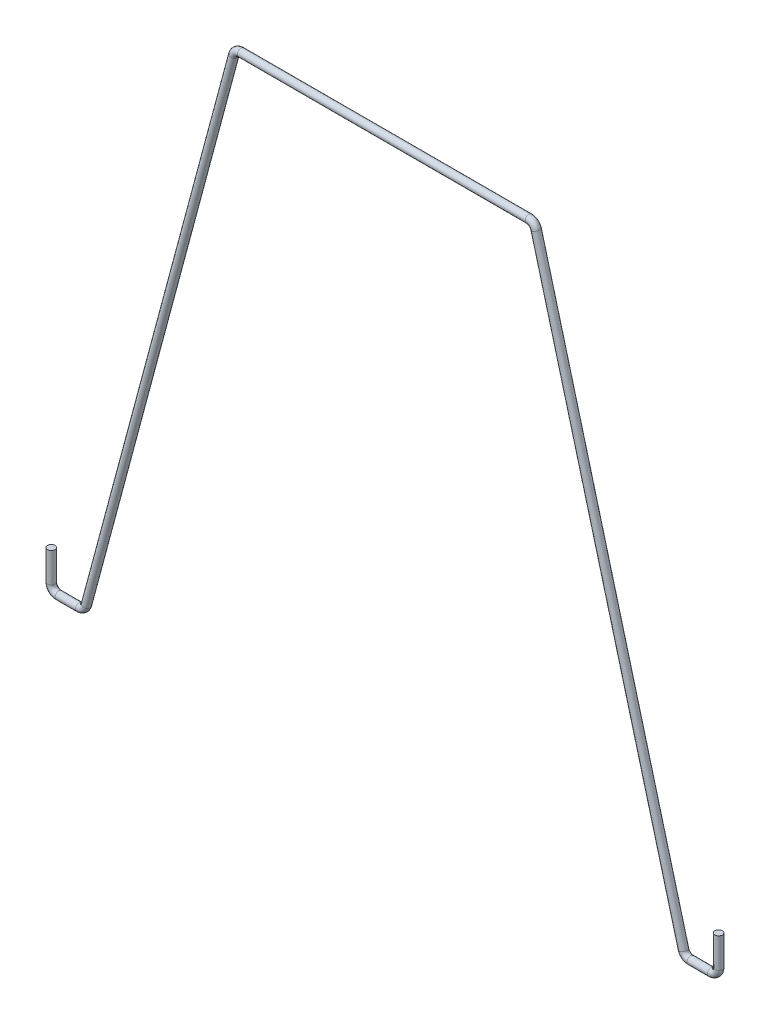
ISO-10303-21;
HEADER;
FILE_DESCRIPTION(('STEP AP214'),'2;1');
FILE_NAME('part.step','',(''),(''),'','','');
FILE_SCHEMA(('AUTOMOTIVE_DESIGN { 1 0 10303 214 1 1 1 1 }'));
ENDSEC;
DATA;
#1=APPLICATION_CONTEXT('core data for automotive mechanical design processes');
#2=APPLICATION_PROTOCOL_DEFINITION('international standard','automotive_design',2000,#1);
#3=PRODUCT_CONTEXT('',#1,'mechanical');
#4=PRODUCT('Part','Part','',(#3));
#5=PRODUCT_RELATED_PRODUCT_CATEGORY('part','',(#4));
#6=PRODUCT_DEFINITION_FORMATION('','',#4);
#7=PRODUCT_DEFINITION_CONTEXT('part definition',#1,'design');
#8=PRODUCT_DEFINITION('design','',#6,#7);
#9=PRODUCT_DEFINITION_SHAPE('','',#8);
#10=(LENGTH_UNIT() NAMED_UNIT(*) SI_UNIT(.MILLI.,.METRE.));
#11=(NAMED_UNIT(*) PLANE_ANGLE_UNIT() SI_UNIT($,.RADIAN.));
#12=(NAMED_UNIT(*) SI_UNIT($,.STERADIAN.) SOLID_ANGLE_UNIT());
#13=UNCERTAINTY_MEASURE_WITH_UNIT(LENGTH_MEASURE(1.E-05),#10,'distance_accuracy_value','');
#14=(GEOMETRIC_REPRESENTATION_CONTEXT(3) GLOBAL_UNCERTAINTY_ASSIGNED_CONTEXT((#13)) GLOBAL_UNIT_ASSIGNED_CONTEXT((#10,
#11,#12)) REPRESENTATION_CONTEXT('',''));
#15=CARTESIAN_POINT('',(0.,0.,0.));
#16=DIRECTION('',(0.,0.,1.));
#17=DIRECTION('',(1.,0.,0.));
#18=AXIS2_PLACEMENT_3D('',#15,#16,#17);
#19=CARTESIAN_POINT('',(-22.6548642316256,-35.56,0.));
#20=DIRECTION('',(0.,1.,0.));
#21=DIRECTION('',(-1.,0.,0.));
#22=AXIS2_PLACEMENT_3D('',#19,#20,#21);
#23=PLANE('',#22);
#24=CARTESIAN_POINT('',(-22.6548642316256,-35.56,0.));
#25=DIRECTION('',(0.,1.,0.));
#26=DIRECTION('',(-1.,0.,0.));
#27=AXIS2_PLACEMENT_3D('',#24,#25,#26);
#28=CIRCLE('',#27,0.254000000000001);
#29=CARTESIAN_POINT('',(-22.9088642316256,-35.56,0.));
#30=VERTEX_POINT('',#29);
#31=EDGE_CURVE('E108',#30,#30,#28,.T.);
#32=ORIENTED_EDGE('',*,*,#31,.T.);
#33=EDGE_LOOP('',(#32));
#34=FACE_BOUND('',#33,.T.);
#35=ADVANCED_FACE('F49',(#34),#23,.T.);
#36=CARTESIAN_POINT('',(22.6548642316259,-35.5599999999998,0.));
#37=DIRECTION('',(0.,-1.,0.));
#38=DIRECTION('',(1.,0.,0.));
#39=AXIS2_PLACEMENT_3D('',#36,#37,#38);
#40=PLANE('',#39);
#41=CARTESIAN_POINT('',(22.6548642316259,-35.5599999999998,0.));
#42=DIRECTION('',(0.,-1.,0.));
#43=DIRECTION('',(1.,0.,0.));
#44=AXIS2_PLACEMENT_3D('',#41,#42,#43);
#45=CIRCLE('',#44,0.254000000000001);
#46=CARTESIAN_POINT('',(22.9088642316259,-35.5599999999998,0.));
#47=VERTEX_POINT('',#46);
#48=EDGE_CURVE('E11',#47,#47,#45,.T.);
#49=ORIENTED_EDGE('',*,*,#48,.F.);
#50=EDGE_LOOP('',(#49));
#51=FACE_BOUND('',#50,.T.);
#52=ADVANCED_FACE('F117',(#51),#40,.F.);
#53=CARTESIAN_POINT('',(-22.6548642316256,-35.56,0.));
#54=DIRECTION('',(0.,-1.,0.));
#55=DIRECTION('',(1.,0.,0.));
#56=AXIS2_PLACEMENT_3D('',#53,#54,#55);
#57=CYLINDRICAL_SURFACE('',#56,0.254000000000001);
#58=CARTESIAN_POINT('',(-22.6548642316256,-37.592,0.));
#59=DIRECTION('',(0.,1.,0.));
#60=DIRECTION('',(-1.,0.,0.));
#61=AXIS2_PLACEMENT_3D('',#58,#59,#60);
#62=CIRCLE('',#61,0.254000000000001);
#63=CARTESIAN_POINT('',(-22.9088642316256,-37.592,0.));
#64=VERTEX_POINT('',#63);
#65=EDGE_CURVE('E104',#64,#64,#62,.T.);
#66=ORIENTED_EDGE('',*,*,#65,.T.);
#67=EDGE_LOOP('',(#66));
#68=FACE_BOUND('',#67,.T.);
#69=ORIENTED_EDGE('',*,*,#31,.F.);
#70=EDGE_LOOP('',(#69));
#71=FACE_BOUND('',#70,.T.);
#72=ADVANCED_FACE('F114',(#68,#71),#57,.T.);
#73=CARTESIAN_POINT('',(-22.1468642316256,-37.592,0.));
#74=DIRECTION('',(0.,0.,1.));
#75=DIRECTION('',(1.,0.,0.));
#76=AXIS2_PLACEMENT_3D('',#73,#74,#75);
#77=TOROIDAL_SURFACE('',#76,0.508000000000002,0.254000000000001);
#78=CARTESIAN_POINT('',(-22.1468642316256,-38.1,0.));
#79=DIRECTION('',(-1.,0.,0.));
#80=DIRECTION('',(0.,-1.,0.));
#81=AXIS2_PLACEMENT_3D('',#78,#79,#80);
#82=CIRCLE('',#81,0.254000000000001);
#83=CARTESIAN_POINT('',(-22.1468642316256,-38.354,0.));
#84=VERTEX_POINT('',#83);
#85=EDGE_CURVE('E100',#84,#84,#82,.T.);
#86=CARTESIAN_POINT('',(-22.1468642316256,-37.592,0.));
#87=DIRECTION('',(0.,0.,1.));
#88=DIRECTION('',(1.,0.,0.));
#89=AXIS2_PLACEMENT_3D('',#86,#87,#88);
#90=CIRCLE('',#89,0.762000000000002);
#91=EDGE_CURVE('',#64,#84,#90,.T.);
#92=ORIENTED_EDGE('',*,*,#65,.F.);
#93=ORIENTED_EDGE('',*,*,#85,.T.);
#94=ORIENTED_EDGE('',*,*,#91,.T.);
#95=ORIENTED_EDGE('',*,*,#91,.F.);
#96=EDGE_LOOP('',(#92,#94,#93,#95));
#97=FACE_BOUND('',#96,.T.);
#98=ADVANCED_FACE('F116',(#97),#77,.T.);
#99=CARTESIAN_POINT('',(-22.1468642316256,-38.1,0.));
#100=DIRECTION('',(1.,0.,0.));
#101=DIRECTION('',(0.,1.,0.));
#102=AXIS2_PLACEMENT_3D('',#99,#100,#101);
#103=CYLINDRICAL_SURFACE('',#102,0.254000000000001);
#104=CARTESIAN_POINT('',(-20.758666341519,-38.1,0.));
#105=DIRECTION('',(-1.,0.,0.));
#106=DIRECTION('',(0.,-1.,0.));
#107=AXIS2_PLACEMENT_3D('',#104,#105,#106);
#108=CIRCLE('',#107,0.254000000000001);
#109=CARTESIAN_POINT('',(-20.758666341519,-38.354,0.));
#110=VERTEX_POINT('',#109);
#111=EDGE_CURVE('E96',#110,#110,#108,.T.);
#112=ORIENTED_EDGE('',*,*,#111,.T.);
#113=EDGE_LOOP('',(#112));
#114=FACE_BOUND('',#113,.T.);
#115=ORIENTED_EDGE('',*,*,#85,.F.);
#116=EDGE_LOOP('',(#115));
#117=FACE_BOUND('',#116,.T.);
#118=ADVANCED_FACE('F124',(#114,#117),#103,.T.);
#119=CARTESIAN_POINT('',(-20.758666341519,-37.592,0.));
#120=DIRECTION('',(0.,0.,1.));
#121=DIRECTION('',(1.,0.,0.));
#122=AXIS2_PLACEMENT_3D('',#119,#120,#121);
#123=TOROIDAL_SURFACE('',#122,0.508000000000002,0.254000000000001);
#124=CARTESIAN_POINT('',(-20.2679760217641,-37.7234800749121,0.));
#125=DIRECTION('',(-0.258819045102509,-0.965925826289072,0.));
#126=DIRECTION('',(0.965925826289071,-0.258819045102509,0.));
#127=AXIS2_PLACEMENT_3D('',#124,#125,#126);
#128=CIRCLE('',#127,0.254000000000001);
#129=CARTESIAN_POINT('',(-20.0226308618867,-37.7892201123681,0.));
#130=VERTEX_POINT('',#129);
#131=EDGE_CURVE('E92',#130,#130,#128,.T.);
#132=CARTESIAN_POINT('',(-20.758666341519,-37.592,0.));
#133=DIRECTION('',(0.,0.,1.));
#134=DIRECTION('',(1.,0.,0.));
#135=AXIS2_PLACEMENT_3D('',#132,#133,#134);
#136=CIRCLE('',#135,0.762000000000002);
#137=EDGE_CURVE('',#110,#130,#136,.T.);
#138=ORIENTED_EDGE('',*,*,#111,.F.);
#139=ORIENTED_EDGE('',*,*,#131,.T.);
#140=ORIENTED_EDGE('',*,*,#137,.T.);
#141=ORIENTED_EDGE('',*,*,#137,.F.);
#142=EDGE_LOOP('',(#138,#140,#139,#141));
#143=FACE_BOUND('',#142,.T.);
#144=ADVANCED_FACE('F165',(#143),#123,.T.);
#145=CARTESIAN_POINT('',(-20.2679760217641,-37.7234800749121,0.));
#146=DIRECTION('',(0.258819045102518,0.965925826289069,0.));
#147=DIRECTION('',(-0.965925826289069,0.258819045102518,0.));
#148=AXIS2_PLACEMENT_3D('',#145,#146,#147);
#149=CYLINDRICAL_SURFACE('',#148,0.254000000000001);
#150=CARTESIAN_POINT('',(-10.2608882098615,-0.376519925087922,0.));
#151=DIRECTION('',(-0.258819045102521,-0.965925826289068,0.));
#152=DIRECTION('',(0.965925826289068,-0.258819045102521,0.));
#153=AXIS2_PLACEMENT_3D('',#150,#151,#152);
#154=CIRCLE('',#153,0.254000000000001);
#155=CARTESIAN_POINT('',(-10.506233369739,-0.310779887631882,0.));
#156=VERTEX_POINT('',#155);
#157=EDGE_CURVE('E88',#156,#156,#154,.T.);
#158=ORIENTED_EDGE('',*,*,#157,.T.);
#159=EDGE_LOOP('',(#158));
#160=FACE_BOUND('',#159,.T.);
#161=ORIENTED_EDGE('',*,*,#131,.F.);
#162=EDGE_LOOP('',(#161));
#163=FACE_BOUND('',#162,.T.);
#164=ADVANCED_FACE('F161',(#160,#163),#149,.T.);
#165=CARTESIAN_POINT('',(-9.77019789010669,-0.508000000000001,0.));
#166=DIRECTION('',(0.,0.,-1.));
#167=DIRECTION('',(-1.,0.,0.));
#168=AXIS2_PLACEMENT_3D('',#165,#166,#167);
#169=TOROIDAL_SURFACE('',#168,0.508000000000008,0.254000000000001);
#170=CARTESIAN_POINT('',(-9.77019789010668,0.,0.));
#171=DIRECTION('',(-1.,0.,0.));
#172=DIRECTION('',(0.,-1.,0.));
#173=AXIS2_PLACEMENT_3D('',#170,#171,#172);
#174=CIRCLE('',#173,0.254000000000001);
#175=CARTESIAN_POINT('',(-9.77019789010668,0.254000000000007,0.));
#176=VERTEX_POINT('',#175);
#177=EDGE_CURVE('E84',#176,#176,#174,.T.);
#178=CARTESIAN_POINT('',(-9.77019789010669,-0.508000000000001,0.));
#179=DIRECTION('',(0.,0.,-1.));
#180=DIRECTION('',(-1.,0.,0.));
#181=AXIS2_PLACEMENT_3D('',#178,#179,#180);
#182=CIRCLE('',#181,0.762000000000008);
#183=EDGE_CURVE('',#156,#176,#182,.T.);
#184=ORIENTED_EDGE('',*,*,#157,.F.);
#185=ORIENTED_EDGE('',*,*,#177,.T.);
#186=ORIENTED_EDGE('',*,*,#183,.T.);
#187=ORIENTED_EDGE('',*,*,#183,.F.);
#188=EDGE_LOOP('',(#184,#186,#185,#187));
#189=FACE_BOUND('',#188,.T.);
#190=ADVANCED_FACE('F157',(#189),#169,.T.);
#191=CARTESIAN_POINT('',(-9.77019789010668,0.,0.));
#192=DIRECTION('',(1.,0.,0.));
#193=DIRECTION('',(0.,1.,0.));
#194=AXIS2_PLACEMENT_3D('',#191,#192,#193);
#195=CYLINDRICAL_SURFACE('',#194,0.254000000000001);
#196=CARTESIAN_POINT('',(9.77019789010668,0.,0.));
#197=DIRECTION('',(-1.,0.,0.));
#198=DIRECTION('',(0.,-1.,0.));
#199=AXIS2_PLACEMENT_3D('',#196,#197,#198);
#200=CIRCLE('',#199,0.254000000000001);
#201=CARTESIAN_POINT('',(9.77019789010668,0.25400000000007,0.));
#202=VERTEX_POINT('',#201);
#203=EDGE_CURVE('E80',#202,#202,#200,.T.);
#204=ORIENTED_EDGE('',*,*,#203,.T.);
#205=EDGE_LOOP('',(#204));
#206=FACE_BOUND('',#205,.T.);
#207=ORIENTED_EDGE('',*,*,#177,.F.);
#208=EDGE_LOOP('',(#207));
#209=FACE_BOUND('',#208,.T.);
#210=ADVANCED_FACE('F153',(#206,#209),#195,.T.);
#211=CARTESIAN_POINT('',(9.77019789010669,-0.507999999999934,0.));
#212=DIRECTION('',(0.,0.,-1.));
#213=DIRECTION('',(-1.,0.,0.));
#214=AXIS2_PLACEMENT_3D('',#211,#212,#213);
#215=TOROIDAL_SURFACE('',#214,0.508000000000003,0.254000000000001);
#216=CARTESIAN_POINT('',(10.2608882098615,-0.376519925087849,0.));
#217=DIRECTION('',(-0.258819045102514,0.96592582628907,0.));
#218=DIRECTION('',(-0.96592582628907,-0.258819045102514,0.));
#219=AXIS2_PLACEMENT_3D('',#216,#217,#218);
#220=CIRCLE('',#219,0.254000000000001);
#221=CARTESIAN_POINT('',(10.506233369739,-0.310779887631807,0.));
#222=VERTEX_POINT('',#221);
#223=EDGE_CURVE('E76',#222,#222,#220,.T.);
#224=CARTESIAN_POINT('',(9.77019789010669,-0.507999999999934,0.));
#225=DIRECTION('',(0.,0.,-1.));
#226=DIRECTION('',(-1.,0.,0.));
#227=AXIS2_PLACEMENT_3D('',#224,#225,#226);
#228=CIRCLE('',#227,0.762000000000004);
#229=EDGE_CURVE('',#202,#222,#228,.T.);
#230=ORIENTED_EDGE('',*,*,#203,.F.);
#231=ORIENTED_EDGE('',*,*,#223,.T.);
#232=ORIENTED_EDGE('',*,*,#229,.T.);
#233=ORIENTED_EDGE('',*,*,#229,.F.);
#234=EDGE_LOOP('',(#230,#232,#231,#233));
#235=FACE_BOUND('',#234,.T.);
#236=ADVANCED_FACE('F149',(#235),#215,.T.);
#237=CARTESIAN_POINT('',(10.2608882098615,-0.376519925087849,0.));
#238=DIRECTION('',(0.258819045102524,-0.965925826289067,0.));
#239=DIRECTION('',(0.965925826289067,0.258819045102524,0.));
#240=AXIS2_PLACEMENT_3D('',#237,#238,#239);
#241=CYLINDRICAL_SURFACE('',#240,0.254000000000001);
#242=CARTESIAN_POINT('',(20.2679760217644,-37.7234800749119,0.));
#243=DIRECTION('',(-0.258819045102521,0.965925826289068,0.));
#244=DIRECTION('',(-0.965925826289068,-0.258819045102521,0.));
#245=AXIS2_PLACEMENT_3D('',#242,#243,#244);
#246=CIRCLE('',#245,0.254000000000001);
#247=CARTESIAN_POINT('',(20.0226308618869,-37.7892201123679,0.));
#248=VERTEX_POINT('',#247);
#249=EDGE_CURVE('E72',#248,#248,#246,.T.);
#250=ORIENTED_EDGE('',*,*,#249,.T.);
#251=EDGE_LOOP('',(#250));
#252=FACE_BOUND('',#251,.T.);
#253=ORIENTED_EDGE('',*,*,#223,.F.);
#254=EDGE_LOOP('',(#253));
#255=FACE_BOUND('',#254,.T.);
#256=ADVANCED_FACE('F145',(#252,#255),#241,.T.);
#257=CARTESIAN_POINT('',(20.7586663415192,-37.5919999999998,0.));
#258=DIRECTION('',(0.,0.,1.));
#259=DIRECTION('',(1.,0.,0.));
#260=AXIS2_PLACEMENT_3D('',#257,#258,#259);
#261=TOROIDAL_SURFACE('',#260,0.508000000000001,0.254000000000001);
#262=CARTESIAN_POINT('',(20.7586663415192,-38.0999999999998,0.));
#263=DIRECTION('',(-1.,0.,0.));
#264=DIRECTION('',(0.,-1.,0.));
#265=AXIS2_PLACEMENT_3D('',#262,#263,#264);
#266=CIRCLE('',#265,0.254000000000001);
#267=CARTESIAN_POINT('',(20.7586663415192,-38.3539999999998,0.));
#268=VERTEX_POINT('',#267);
#269=EDGE_CURVE('E66',#268,#268,#266,.T.);
#270=CARTESIAN_POINT('',(20.7586663415192,-37.5919999999998,0.));
#271=DIRECTION('',(0.,0.,1.));
#272=DIRECTION('',(1.,0.,0.));
#273=AXIS2_PLACEMENT_3D('',#270,#271,#272);
#274=CIRCLE('',#273,0.762000000000001);
#275=EDGE_CURVE('',#248,#268,#274,.T.);
#276=ORIENTED_EDGE('',*,*,#249,.F.);
#277=ORIENTED_EDGE('',*,*,#269,.T.);
#278=ORIENTED_EDGE('',*,*,#275,.T.);
#279=ORIENTED_EDGE('',*,*,#275,.F.);
#280=EDGE_LOOP('',(#276,#278,#277,#279));
#281=FACE_BOUND('',#280,.T.);
#282=ADVANCED_FACE('F141',(#281),#261,.T.);
#283=CARTESIAN_POINT('',(20.7586663415192,-38.0999999999998,0.));
#284=DIRECTION('',(1.,0.,0.));
#285=DIRECTION('',(0.,1.,0.));
#286=AXIS2_PLACEMENT_3D('',#283,#284,#285);
#287=CYLINDRICAL_SURFACE('',#286,0.254000000000001);
#288=CARTESIAN_POINT('',(22.1468642316259,-38.0999999999998,0.));
#289=DIRECTION('',(-1.,0.,0.));
#290=DIRECTION('',(0.,-1.,0.));
#291=AXIS2_PLACEMENT_3D('',#288,#289,#290);
#292=CIRCLE('',#291,0.254000000000001);
#293=CARTESIAN_POINT('',(22.1468642316259,-38.3539999999998,0.));
#294=VERTEX_POINT('',#293);
#295=EDGE_CURVE('E61',#294,#294,#292,.T.);
#296=ORIENTED_EDGE('',*,*,#295,.T.);
#297=EDGE_LOOP('',(#296));
#298=FACE_BOUND('',#297,.T.);
#299=ORIENTED_EDGE('',*,*,#269,.F.);
#300=EDGE_LOOP('',(#299));
#301=FACE_BOUND('',#300,.T.);
#302=ADVANCED_FACE('F135',(#298,#301),#287,.T.);
#303=CARTESIAN_POINT('',(22.1468642316259,-37.5919999999998,0.));
#304=DIRECTION('',(0.,0.,1.));
#305=DIRECTION('',(1.,0.,0.));
#306=AXIS2_PLACEMENT_3D('',#303,#304,#305);
#307=TOROIDAL_SURFACE('',#306,0.508000000000002,0.254000000000001);
#308=CARTESIAN_POINT('',(22.6548642316262,-37.5919999999996,0.));
#309=DIRECTION('',(0.,-1.,0.));
#310=DIRECTION('',(1.,0.,0.));
#311=AXIS2_PLACEMENT_3D('',#308,#309,#310);
#312=CIRCLE('',#311,0.254000000000001);
#313=CARTESIAN_POINT('',(22.9088642316259,-37.5919999999995,0.));
#314=VERTEX_POINT('',#313);
#315=EDGE_CURVE('E56',#314,#314,#312,.T.);
#316=CARTESIAN_POINT('',(22.1468642316259,-37.5919999999998,0.));
#317=DIRECTION('',(0.,0.,1.));
#318=DIRECTION('',(1.,0.,0.));
#319=AXIS2_PLACEMENT_3D('',#316,#317,#318);
#320=CIRCLE('',#319,0.762000000000002);
#321=EDGE_CURVE('',#294,#314,#320,.T.);
#322=ORIENTED_EDGE('',*,*,#295,.F.);
#323=ORIENTED_EDGE('',*,*,#315,.T.);
#324=ORIENTED_EDGE('',*,*,#321,.T.);
#325=ORIENTED_EDGE('',*,*,#321,.F.);
#326=EDGE_LOOP('',(#322,#324,#323,#325));
#327=FACE_BOUND('',#326,.T.);
#328=ADVANCED_FACE('F130',(#327),#307,.T.);
#329=CARTESIAN_POINT('',(22.6548642316259,-37.5919999999998,0.));
#330=DIRECTION('',(0.,1.,0.));
#331=DIRECTION('',(-1.,0.,0.));
#332=AXIS2_PLACEMENT_3D('',#329,#330,#331);
#333=CYLINDRICAL_SURFACE('',#332,0.254000000000001);
#334=ORIENTED_EDGE('',*,*,#48,.T.);
#335=EDGE_LOOP('',(#334));
#336=FACE_BOUND('',#335,.T.);
#337=ORIENTED_EDGE('',*,*,#315,.F.);
#338=EDGE_LOOP('',(#337));
#339=FACE_BOUND('',#338,.T.);
#340=ADVANCED_FACE('F128',(#336,#339),#333,.T.);
#341=CLOSED_SHELL('',(#35,#52,#72,#98,#118,#144,#164,#190,#210,#236,#256,#282,#302,#328,#340));
#342=MANIFOLD_SOLID_BREP('B2',#341);
#343=ADVANCED_BREP_SHAPE_REPRESENTATION('',(#18,#342),#14);
#344=SHAPE_DEFINITION_REPRESENTATION(#9,#343);
ENDSEC;
END-ISO-10303-21;
